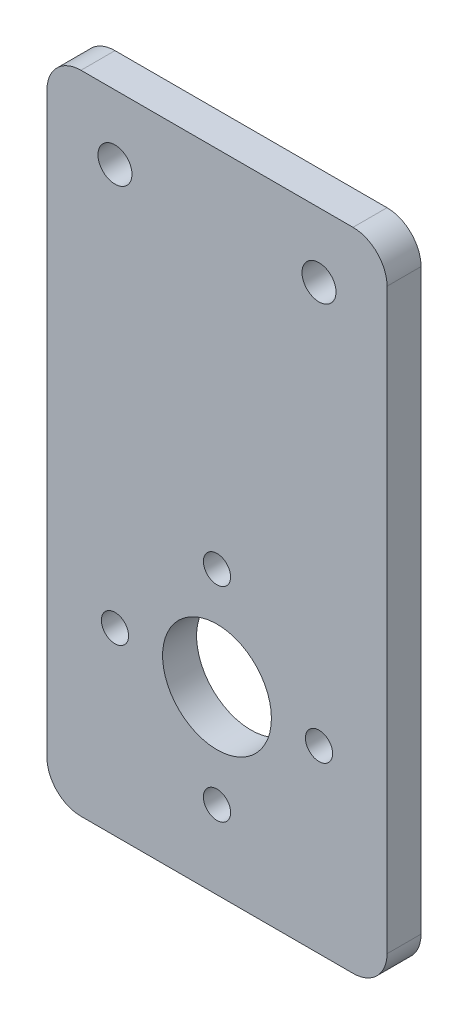
ISO-10303-21;
HEADER;
FILE_DESCRIPTION(('STEP AP214'),'2;1');
FILE_NAME('part.step','',(''),(''),'','','');
FILE_SCHEMA(('AUTOMOTIVE_DESIGN { 1 0 10303 214 1 1 1 1 }'));
ENDSEC;
DATA;
#1=APPLICATION_CONTEXT('core data for automotive mechanical design processes');
#2=APPLICATION_PROTOCOL_DEFINITION('international standard','automotive_design',2000,#1);
#3=PRODUCT_CONTEXT('',#1,'mechanical');
#4=PRODUCT('Part','Part','',(#3));
#5=PRODUCT_RELATED_PRODUCT_CATEGORY('part','',(#4));
#6=PRODUCT_DEFINITION_FORMATION('','',#4);
#7=PRODUCT_DEFINITION_CONTEXT('part definition',#1,'design');
#8=PRODUCT_DEFINITION('design','',#6,#7);
#9=PRODUCT_DEFINITION_SHAPE('','',#8);
#10=(LENGTH_UNIT() NAMED_UNIT(*) SI_UNIT(.MILLI.,.METRE.));
#11=(NAMED_UNIT(*) PLANE_ANGLE_UNIT() SI_UNIT($,.RADIAN.));
#12=(NAMED_UNIT(*) SI_UNIT($,.STERADIAN.) SOLID_ANGLE_UNIT());
#13=UNCERTAINTY_MEASURE_WITH_UNIT(LENGTH_MEASURE(1.E-05),#10,'distance_accuracy_value','');
#14=(GEOMETRIC_REPRESENTATION_CONTEXT(3) GLOBAL_UNCERTAINTY_ASSIGNED_CONTEXT((#13)) GLOBAL_UNIT_ASSIGNED_CONTEXT((#10,
#11,#12)) REPRESENTATION_CONTEXT('',''));
#15=CARTESIAN_POINT('',(0.,0.,0.));
#16=DIRECTION('',(0.,0.,1.));
#17=DIRECTION('',(1.,0.,0.));
#18=AXIS2_PLACEMENT_3D('',#15,#16,#17);
#19=CARTESIAN_POINT('',(0.,0.,5.));
#20=DIRECTION('',(0.,0.,1.));
#21=DIRECTION('',(1.,0.,0.));
#22=AXIS2_PLACEMENT_3D('',#19,#20,#21);
#23=PLANE('',#22);
#24=CARTESIAN_POINT('',(25.0000000000005,-83.525,5.));
#25=DIRECTION('',(0.,0.,1.));
#26=DIRECTION('',(1.,0.,0.));
#27=AXIS2_PLACEMENT_3D('',#24,#25,#26);
#28=CIRCLE('',#27,2.00000000000001);
#29=CARTESIAN_POINT('',(27.0000000000005,-83.525,5.));
#30=VERTEX_POINT('',#29);
#31=EDGE_CURVE('E249',#30,#30,#28,.T.);
#32=ORIENTED_EDGE('',*,*,#31,.F.);
#33=EDGE_LOOP('',(#32));
#34=FACE_BOUND('',#33,.T.);
#35=CARTESIAN_POINT('',(25.,-53.525,5.));
#36=DIRECTION('',(0.,0.,1.));
#37=DIRECTION('',(1.,0.,0.));
#38=AXIS2_PLACEMENT_3D('',#35,#36,#37);
#39=CIRCLE('',#38,2.);
#40=CARTESIAN_POINT('',(27.,-53.525,5.));
#41=VERTEX_POINT('',#40);
#42=EDGE_CURVE('E233',#41,#41,#39,.T.);
#43=ORIENTED_EDGE('',*,*,#42,.F.);
#44=EDGE_LOOP('',(#43));
#45=FACE_BOUND('',#44,.T.);
#46=CARTESIAN_POINT('',(40.,-9.5,5.));
#47=DIRECTION('',(0.,0.,1.));
#48=DIRECTION('',(1.,0.,0.));
#49=AXIS2_PLACEMENT_3D('',#46,#47,#48);
#50=CIRCLE('',#49,2.5);
#51=CARTESIAN_POINT('',(42.5,-9.5,5.));
#52=VERTEX_POINT('',#51);
#53=EDGE_CURVE('E219',#52,#52,#50,.T.);
#54=ORIENTED_EDGE('',*,*,#53,.F.);
#55=EDGE_LOOP('',(#54));
#56=FACE_BOUND('',#55,.T.);
#57=DIRECTION('',(1.,0.,0.));
#58=VECTOR('',#57,1.);
#59=CARTESIAN_POINT('',(0.,-95.,5.));
#60=LINE('',#59,#58);
#61=CARTESIAN_POINT('',(5.00000000000001,-95.,5.));
#62=VERTEX_POINT('',#61);
#63=CARTESIAN_POINT('',(45.,-95.,5.));
#64=VERTEX_POINT('',#63);
#65=EDGE_CURVE('E199',#62,#64,#60,.T.);
#66=ORIENTED_EDGE('',*,*,#65,.T.);
#67=CARTESIAN_POINT('',(45.,-90.,5.));
#68=DIRECTION('',(0.,0.,1.));
#69=DIRECTION('',(1.,0.,0.));
#70=AXIS2_PLACEMENT_3D('',#67,#68,#69);
#71=CIRCLE('',#70,5.);
#72=CARTESIAN_POINT('',(50.,-90.,5.));
#73=VERTEX_POINT('',#72);
#74=EDGE_CURVE('E172',#64,#73,#71,.T.);
#75=ORIENTED_EDGE('',*,*,#74,.T.);
#76=DIRECTION('',(0.,1.,0.));
#77=VECTOR('',#76,1.);
#78=CARTESIAN_POINT('',(50.,0.,5.));
#79=LINE('',#78,#77);
#80=CARTESIAN_POINT('',(50.,-5.,5.));
#81=VERTEX_POINT('',#80);
#82=EDGE_CURVE('E129',#73,#81,#79,.T.);
#83=ORIENTED_EDGE('',*,*,#82,.T.);
#84=CARTESIAN_POINT('',(45.,-5.,5.));
#85=DIRECTION('',(0.,0.,1.));
#86=DIRECTION('',(1.,0.,0.));
#87=AXIS2_PLACEMENT_3D('',#84,#85,#86);
#88=CIRCLE('',#87,5.);
#89=CARTESIAN_POINT('',(45.,0.,5.));
#90=VERTEX_POINT('',#89);
#91=EDGE_CURVE('E64',#81,#90,#88,.T.);
#92=ORIENTED_EDGE('',*,*,#91,.T.);
#93=DIRECTION('',(-1.,0.,0.));
#94=VECTOR('',#93,1.);
#95=CARTESIAN_POINT('',(0.,0.,5.));
#96=LINE('',#95,#94);
#97=CARTESIAN_POINT('',(5.,0.,5.));
#98=VERTEX_POINT('',#97);
#99=EDGE_CURVE('E150',#90,#98,#96,.T.);
#100=ORIENTED_EDGE('',*,*,#99,.T.);
#101=CARTESIAN_POINT('',(5.,-5.,5.));
#102=DIRECTION('',(0.,0.,1.));
#103=DIRECTION('',(1.,0.,0.));
#104=AXIS2_PLACEMENT_3D('',#101,#102,#103);
#105=CIRCLE('',#104,5.);
#106=CARTESIAN_POINT('',(0.,-5.,5.));
#107=VERTEX_POINT('',#106);
#108=EDGE_CURVE('E166',#98,#107,#105,.T.);
#109=ORIENTED_EDGE('',*,*,#108,.T.);
#110=DIRECTION('',(0.,-1.,0.));
#111=VECTOR('',#110,1.);
#112=CARTESIAN_POINT('',(0.,0.,5.));
#113=LINE('',#112,#111);
#114=CARTESIAN_POINT('',(0.,-90.,5.));
#115=VERTEX_POINT('',#114);
#116=EDGE_CURVE('E143',#107,#115,#113,.T.);
#117=ORIENTED_EDGE('',*,*,#116,.T.);
#118=CARTESIAN_POINT('',(5.00000000000001,-90.,5.));
#119=DIRECTION('',(0.,0.,1.));
#120=DIRECTION('',(1.,0.,0.));
#121=AXIS2_PLACEMENT_3D('',#118,#119,#120);
#122=CIRCLE('',#121,5.);
#123=EDGE_CURVE('E169',#115,#62,#122,.T.);
#124=ORIENTED_EDGE('',*,*,#123,.T.);
#125=EDGE_LOOP('',(#66,#75,#83,#92,#100,#109,#117,#124));
#126=FACE_BOUND('',#125,.T.);
#127=CARTESIAN_POINT('',(10.,-9.5,5.));
#128=DIRECTION('',(0.,0.,1.));
#129=DIRECTION('',(1.,0.,0.));
#130=AXIS2_PLACEMENT_3D('',#127,#128,#129);
#131=CIRCLE('',#130,2.5);
#132=CARTESIAN_POINT('',(12.5,-9.5,5.));
#133=VERTEX_POINT('',#132);
#134=EDGE_CURVE('E212',#133,#133,#131,.T.);
#135=ORIENTED_EDGE('',*,*,#134,.F.);
#136=EDGE_LOOP('',(#135));
#137=FACE_BOUND('',#136,.T.);
#138=CARTESIAN_POINT('',(25.,-68.525,5.));
#139=DIRECTION('',(0.,0.,1.));
#140=DIRECTION('',(1.,0.,0.));
#141=AXIS2_PLACEMENT_3D('',#138,#139,#140);
#142=CIRCLE('',#141,8.);
#143=CARTESIAN_POINT('',(33.,-68.525,5.));
#144=VERTEX_POINT('',#143);
#145=EDGE_CURVE('E225',#144,#144,#142,.T.);
#146=ORIENTED_EDGE('',*,*,#145,.F.);
#147=EDGE_LOOP('',(#146));
#148=FACE_BOUND('',#147,.T.);
#149=CARTESIAN_POINT('',(40.0000000000003,-68.5249999999997,5.));
#150=DIRECTION('',(0.,0.,1.));
#151=DIRECTION('',(1.,0.,0.));
#152=AXIS2_PLACEMENT_3D('',#149,#150,#151);
#153=CIRCLE('',#152,2.);
#154=CARTESIAN_POINT('',(42.0000000000003,-68.5249999999997,5.));
#155=VERTEX_POINT('',#154);
#156=EDGE_CURVE('E241',#155,#155,#153,.T.);
#157=ORIENTED_EDGE('',*,*,#156,.F.);
#158=EDGE_LOOP('',(#157));
#159=FACE_BOUND('',#158,.T.);
#160=CARTESIAN_POINT('',(10.0000000000003,-68.5250000000002,5.));
#161=DIRECTION('',(0.,0.,1.));
#162=DIRECTION('',(1.,0.,0.));
#163=AXIS2_PLACEMENT_3D('',#160,#161,#162);
#164=CIRCLE('',#163,2.);
#165=CARTESIAN_POINT('',(12.0000000000003,-68.5250000000002,5.));
#166=VERTEX_POINT('',#165);
#167=EDGE_CURVE('E257',#166,#166,#164,.T.);
#168=ORIENTED_EDGE('',*,*,#167,.F.);
#169=EDGE_LOOP('',(#168));
#170=FACE_BOUND('',#169,.T.);
#171=ADVANCED_FACE('F43',(#34,#45,#56,#126,#137,#148,#159,#170),#23,.T.);
#172=CARTESIAN_POINT('',(0.,0.,0.));
#173=DIRECTION('',(0.,0.,1.));
#174=DIRECTION('',(1.,0.,0.));
#175=AXIS2_PLACEMENT_3D('',#172,#173,#174);
#176=PLANE('',#175);
#177=DIRECTION('',(0.,1.,0.));
#178=VECTOR('',#177,1.);
#179=CARTESIAN_POINT('',(50.,0.,0.));
#180=LINE('',#179,#178);
#181=CARTESIAN_POINT('',(50.,-90.,0.));
#182=VERTEX_POINT('',#181);
#183=CARTESIAN_POINT('',(50.,-5.,0.));
#184=VERTEX_POINT('',#183);
#185=EDGE_CURVE('E127',#182,#184,#180,.T.);
#186=ORIENTED_EDGE('',*,*,#185,.F.);
#187=CARTESIAN_POINT('',(45.,-90.,0.));
#188=DIRECTION('',(0.,0.,1.));
#189=DIRECTION('',(1.,0.,0.));
#190=AXIS2_PLACEMENT_3D('',#187,#188,#189);
#191=CIRCLE('',#190,5.);
#192=CARTESIAN_POINT('',(45.,-95.,0.));
#193=VERTEX_POINT('',#192);
#194=EDGE_CURVE('E109',#182,#193,#191,.F.);
#195=ORIENTED_EDGE('',*,*,#194,.T.);
#196=DIRECTION('',(1.,0.,0.));
#197=VECTOR('',#196,1.);
#198=CARTESIAN_POINT('',(0.,-95.,0.));
#199=LINE('',#198,#197);
#200=CARTESIAN_POINT('',(5.00000000000001,-95.,0.));
#201=VERTEX_POINT('',#200);
#202=EDGE_CURVE('E139',#201,#193,#199,.T.);
#203=ORIENTED_EDGE('',*,*,#202,.F.);
#204=CARTESIAN_POINT('',(5.00000000000001,-90.,0.));
#205=DIRECTION('',(0.,0.,1.));
#206=DIRECTION('',(1.,0.,0.));
#207=AXIS2_PLACEMENT_3D('',#204,#205,#206);
#208=CIRCLE('',#207,5.);
#209=CARTESIAN_POINT('',(0.,-90.,0.));
#210=VERTEX_POINT('',#209);
#211=EDGE_CURVE('E121',#201,#210,#208,.F.);
#212=ORIENTED_EDGE('',*,*,#211,.T.);
#213=DIRECTION('',(0.,-1.,0.));
#214=VECTOR('',#213,1.);
#215=CARTESIAN_POINT('',(0.,0.,0.));
#216=LINE('',#215,#214);
#217=CARTESIAN_POINT('',(0.,-5.,0.));
#218=VERTEX_POINT('',#217);
#219=EDGE_CURVE('E145',#218,#210,#216,.T.);
#220=ORIENTED_EDGE('',*,*,#219,.F.);
#221=CARTESIAN_POINT('',(5.,-5.,0.));
#222=DIRECTION('',(0.,0.,1.));
#223=DIRECTION('',(1.,0.,0.));
#224=AXIS2_PLACEMENT_3D('',#221,#222,#223);
#225=CIRCLE('',#224,5.);
#226=CARTESIAN_POINT('',(5.,0.,0.));
#227=VERTEX_POINT('',#226);
#228=EDGE_CURVE('E154',#218,#227,#225,.F.);
#229=ORIENTED_EDGE('',*,*,#228,.T.);
#230=DIRECTION('',(-1.,0.,0.));
#231=VECTOR('',#230,1.);
#232=CARTESIAN_POINT('',(0.,0.,0.));
#233=LINE('',#232,#231);
#234=CARTESIAN_POINT('',(45.,0.,0.));
#235=VERTEX_POINT('',#234);
#236=EDGE_CURVE('E138',#235,#227,#233,.T.);
#237=ORIENTED_EDGE('',*,*,#236,.F.);
#238=CARTESIAN_POINT('',(45.,-5.,0.));
#239=DIRECTION('',(0.,0.,1.));
#240=DIRECTION('',(1.,0.,0.));
#241=AXIS2_PLACEMENT_3D('',#238,#239,#240);
#242=CIRCLE('',#241,5.);
#243=EDGE_CURVE('E131',#235,#184,#242,.F.);
#244=ORIENTED_EDGE('',*,*,#243,.T.);
#245=EDGE_LOOP('',(#186,#195,#203,#212,#220,#229,#237,#244));
#246=FACE_BOUND('',#245,.T.);
#247=CARTESIAN_POINT('',(10.,-9.5,0.));
#248=DIRECTION('',(0.,0.,1.));
#249=DIRECTION('',(1.,0.,0.));
#250=AXIS2_PLACEMENT_3D('',#247,#248,#249);
#251=CIRCLE('',#250,2.5);
#252=CARTESIAN_POINT('',(12.5,-9.5,0.));
#253=VERTEX_POINT('',#252);
#254=EDGE_CURVE('E205',#253,#253,#251,.T.);
#255=ORIENTED_EDGE('',*,*,#254,.T.);
#256=EDGE_LOOP('',(#255));
#257=FACE_BOUND('',#256,.T.);
#258=CARTESIAN_POINT('',(40.,-9.5,0.));
#259=DIRECTION('',(0.,0.,1.));
#260=DIRECTION('',(1.,0.,0.));
#261=AXIS2_PLACEMENT_3D('',#258,#259,#260);
#262=CIRCLE('',#261,2.5);
#263=CARTESIAN_POINT('',(42.5,-9.5,0.));
#264=VERTEX_POINT('',#263);
#265=EDGE_CURVE('E221',#264,#264,#262,.T.);
#266=ORIENTED_EDGE('',*,*,#265,.T.);
#267=EDGE_LOOP('',(#266));
#268=FACE_BOUND('',#267,.T.);
#269=CARTESIAN_POINT('',(25.,-68.525,0.));
#270=DIRECTION('',(0.,0.,1.));
#271=DIRECTION('',(1.,0.,0.));
#272=AXIS2_PLACEMENT_3D('',#269,#270,#271);
#273=CIRCLE('',#272,8.);
#274=CARTESIAN_POINT('',(33.,-68.525,0.));
#275=VERTEX_POINT('',#274);
#276=EDGE_CURVE('E229',#275,#275,#273,.T.);
#277=ORIENTED_EDGE('',*,*,#276,.T.);
#278=EDGE_LOOP('',(#277));
#279=FACE_BOUND('',#278,.T.);
#280=CARTESIAN_POINT('',(25.,-53.525,0.));
#281=DIRECTION('',(0.,0.,1.));
#282=DIRECTION('',(1.,0.,0.));
#283=AXIS2_PLACEMENT_3D('',#280,#281,#282);
#284=CIRCLE('',#283,2.);
#285=CARTESIAN_POINT('',(27.,-53.525,0.));
#286=VERTEX_POINT('',#285);
#287=EDGE_CURVE('E237',#286,#286,#284,.T.);
#288=ORIENTED_EDGE('',*,*,#287,.T.);
#289=EDGE_LOOP('',(#288));
#290=FACE_BOUND('',#289,.T.);
#291=CARTESIAN_POINT('',(40.0000000000003,-68.5249999999997,0.));
#292=DIRECTION('',(0.,0.,1.));
#293=DIRECTION('',(1.,0.,0.));
#294=AXIS2_PLACEMENT_3D('',#291,#292,#293);
#295=CIRCLE('',#294,2.);
#296=CARTESIAN_POINT('',(42.0000000000003,-68.5249999999997,0.));
#297=VERTEX_POINT('',#296);
#298=EDGE_CURVE('E245',#297,#297,#295,.T.);
#299=ORIENTED_EDGE('',*,*,#298,.T.);
#300=EDGE_LOOP('',(#299));
#301=FACE_BOUND('',#300,.T.);
#302=CARTESIAN_POINT('',(25.0000000000005,-83.525,0.));
#303=DIRECTION('',(0.,0.,1.));
#304=DIRECTION('',(1.,0.,0.));
#305=AXIS2_PLACEMENT_3D('',#302,#303,#304);
#306=CIRCLE('',#305,2.00000000000001);
#307=CARTESIAN_POINT('',(27.0000000000005,-83.525,0.));
#308=VERTEX_POINT('',#307);
#309=EDGE_CURVE('E253',#308,#308,#306,.T.);
#310=ORIENTED_EDGE('',*,*,#309,.T.);
#311=EDGE_LOOP('',(#310));
#312=FACE_BOUND('',#311,.T.);
#313=CARTESIAN_POINT('',(10.0000000000003,-68.5250000000002,0.));
#314=DIRECTION('',(0.,0.,1.));
#315=DIRECTION('',(1.,0.,0.));
#316=AXIS2_PLACEMENT_3D('',#313,#314,#315);
#317=CIRCLE('',#316,2.);
#318=CARTESIAN_POINT('',(12.0000000000003,-68.5250000000002,0.));
#319=VERTEX_POINT('',#318);
#320=EDGE_CURVE('E261',#319,#319,#317,.T.);
#321=ORIENTED_EDGE('',*,*,#320,.T.);
#322=EDGE_LOOP('',(#321));
#323=FACE_BOUND('',#322,.T.);
#324=ADVANCED_FACE('F134',(#246,#257,#268,#279,#290,#301,#312,#323),#176,.F.);
#325=CARTESIAN_POINT('',(0.,0.,5.));
#326=DIRECTION('',(1.,0.,0.));
#327=DIRECTION('',(0.,1.,0.));
#328=AXIS2_PLACEMENT_3D('',#325,#326,#327);
#329=PLANE('',#328);
#330=ORIENTED_EDGE('',*,*,#219,.T.);
#331=DIRECTION('',(0.,0.,-1.));
#332=VECTOR('',#331,1.);
#333=CARTESIAN_POINT('',(0.,-90.,5.));
#334=LINE('',#333,#332);
#335=EDGE_CURVE('E179',#210,#115,#334,.F.);
#336=ORIENTED_EDGE('',*,*,#335,.T.);
#337=ORIENTED_EDGE('',*,*,#116,.F.);
#338=DIRECTION('',(0.,0.,-1.));
#339=VECTOR('',#338,1.);
#340=CARTESIAN_POINT('',(0.,-5.,5.));
#341=LINE('',#340,#339);
#342=EDGE_CURVE('E175',#107,#218,#341,.T.);
#343=ORIENTED_EDGE('',*,*,#342,.T.);
#344=EDGE_LOOP('',(#330,#336,#337,#343));
#345=FACE_BOUND('',#344,.T.);
#346=ADVANCED_FACE('F194',(#345),#329,.F.);
#347=CARTESIAN_POINT('',(0.,-95.,5.));
#348=DIRECTION('',(0.,1.,0.));
#349=DIRECTION('',(0.,0.,1.));
#350=AXIS2_PLACEMENT_3D('',#347,#348,#349);
#351=PLANE('',#350);
#352=ORIENTED_EDGE('',*,*,#202,.T.);
#353=DIRECTION('',(0.,0.,-1.));
#354=VECTOR('',#353,1.);
#355=CARTESIAN_POINT('',(45.,-95.,5.));
#356=LINE('',#355,#354);
#357=EDGE_CURVE('E114',#193,#64,#356,.F.);
#358=ORIENTED_EDGE('',*,*,#357,.T.);
#359=ORIENTED_EDGE('',*,*,#65,.F.);
#360=DIRECTION('',(0.,0.,-1.));
#361=VECTOR('',#360,1.);
#362=CARTESIAN_POINT('',(5.00000000000001,-95.,5.));
#363=LINE('',#362,#361);
#364=EDGE_CURVE('E120',#62,#201,#363,.T.);
#365=ORIENTED_EDGE('',*,*,#364,.T.);
#366=EDGE_LOOP('',(#352,#358,#359,#365));
#367=FACE_BOUND('',#366,.T.);
#368=ADVANCED_FACE('F289',(#367),#351,.F.);
#369=CARTESIAN_POINT('',(50.,0.,5.));
#370=DIRECTION('',(-1.,0.,0.));
#371=DIRECTION('',(0.,-1.,0.));
#372=AXIS2_PLACEMENT_3D('',#369,#370,#371);
#373=PLANE('',#372);
#374=ORIENTED_EDGE('',*,*,#82,.F.);
#375=DIRECTION('',(0.,0.,-1.));
#376=VECTOR('',#375,1.);
#377=CARTESIAN_POINT('',(50.,-90.,5.));
#378=LINE('',#377,#376);
#379=EDGE_CURVE('E113',#73,#182,#378,.T.);
#380=ORIENTED_EDGE('',*,*,#379,.T.);
#381=ORIENTED_EDGE('',*,*,#185,.T.);
#382=DIRECTION('',(0.,0.,-1.));
#383=VECTOR('',#382,1.);
#384=CARTESIAN_POINT('',(50.,-5.,5.));
#385=LINE('',#384,#383);
#386=EDGE_CURVE('E132',#184,#81,#385,.F.);
#387=ORIENTED_EDGE('',*,*,#386,.T.);
#388=EDGE_LOOP('',(#374,#380,#381,#387));
#389=FACE_BOUND('',#388,.T.);
#390=ADVANCED_FACE('F126',(#389),#373,.F.);
#391=CARTESIAN_POINT('',(0.,0.,5.));
#392=DIRECTION('',(0.,-1.,0.));
#393=DIRECTION('',(0.,0.,-1.));
#394=AXIS2_PLACEMENT_3D('',#391,#392,#393);
#395=PLANE('',#394);
#396=ORIENTED_EDGE('',*,*,#236,.T.);
#397=DIRECTION('',(0.,0.,-1.));
#398=VECTOR('',#397,1.);
#399=CARTESIAN_POINT('',(5.,0.,5.));
#400=LINE('',#399,#398);
#401=EDGE_CURVE('E11',#227,#98,#400,.F.);
#402=ORIENTED_EDGE('',*,*,#401,.T.);
#403=ORIENTED_EDGE('',*,*,#99,.F.);
#404=DIRECTION('',(0.,0.,-1.));
#405=VECTOR('',#404,1.);
#406=CARTESIAN_POINT('',(45.,0.,5.));
#407=LINE('',#406,#405);
#408=EDGE_CURVE('E52',#90,#235,#407,.T.);
#409=ORIENTED_EDGE('',*,*,#408,.T.);
#410=EDGE_LOOP('',(#396,#402,#403,#409));
#411=FACE_BOUND('',#410,.T.);
#412=ADVANCED_FACE('F184',(#411),#395,.F.);
#413=CARTESIAN_POINT('',(10.,-9.5,5.));
#414=DIRECTION('',(0.,0.,-1.));
#415=DIRECTION('',(-1.,0.,0.));
#416=AXIS2_PLACEMENT_3D('',#413,#414,#415);
#417=CYLINDRICAL_SURFACE('',#416,2.5);
#418=ORIENTED_EDGE('',*,*,#134,.T.);
#419=EDGE_LOOP('',(#418));
#420=FACE_BOUND('',#419,.T.);
#421=ORIENTED_EDGE('',*,*,#254,.F.);
#422=EDGE_LOOP('',(#421));
#423=FACE_BOUND('',#422,.T.);
#424=ADVANCED_FACE('F282',(#420,#423),#417,.F.);
#425=CARTESIAN_POINT('',(40.,-9.5,5.));
#426=DIRECTION('',(0.,0.,-1.));
#427=DIRECTION('',(-1.,0.,0.));
#428=AXIS2_PLACEMENT_3D('',#425,#426,#427);
#429=CYLINDRICAL_SURFACE('',#428,2.5);
#430=ORIENTED_EDGE('',*,*,#53,.T.);
#431=EDGE_LOOP('',(#430));
#432=FACE_BOUND('',#431,.T.);
#433=ORIENTED_EDGE('',*,*,#265,.F.);
#434=EDGE_LOOP('',(#433));
#435=FACE_BOUND('',#434,.T.);
#436=ADVANCED_FACE('F339',(#432,#435),#429,.F.);
#437=CARTESIAN_POINT('',(25.,-68.525,5.));
#438=DIRECTION('',(0.,0.,-1.));
#439=DIRECTION('',(-1.,0.,0.));
#440=AXIS2_PLACEMENT_3D('',#437,#438,#439);
#441=CYLINDRICAL_SURFACE('',#440,8.);
#442=ORIENTED_EDGE('',*,*,#145,.T.);
#443=EDGE_LOOP('',(#442));
#444=FACE_BOUND('',#443,.T.);
#445=ORIENTED_EDGE('',*,*,#276,.F.);
#446=EDGE_LOOP('',(#445));
#447=FACE_BOUND('',#446,.T.);
#448=ADVANCED_FACE('F336',(#444,#447),#441,.F.);
#449=CARTESIAN_POINT('',(25.,-53.525,5.));
#450=DIRECTION('',(0.,0.,-1.));
#451=DIRECTION('',(-1.,0.,0.));
#452=AXIS2_PLACEMENT_3D('',#449,#450,#451);
#453=CYLINDRICAL_SURFACE('',#452,2.);
#454=ORIENTED_EDGE('',*,*,#42,.T.);
#455=EDGE_LOOP('',(#454));
#456=FACE_BOUND('',#455,.T.);
#457=ORIENTED_EDGE('',*,*,#287,.F.);
#458=EDGE_LOOP('',(#457));
#459=FACE_BOUND('',#458,.T.);
#460=ADVANCED_FACE('F318',(#456,#459),#453,.F.);
#461=CARTESIAN_POINT('',(40.0000000000003,-68.5249999999997,5.));
#462=DIRECTION('',(0.,0.,-1.));
#463=DIRECTION('',(-1.,0.,0.));
#464=AXIS2_PLACEMENT_3D('',#461,#462,#463);
#465=CYLINDRICAL_SURFACE('',#464,2.);
#466=ORIENTED_EDGE('',*,*,#156,.T.);
#467=EDGE_LOOP('',(#466));
#468=FACE_BOUND('',#467,.T.);
#469=ORIENTED_EDGE('',*,*,#298,.F.);
#470=EDGE_LOOP('',(#469));
#471=FACE_BOUND('',#470,.T.);
#472=ADVANCED_FACE('F314',(#468,#471),#465,.F.);
#473=CARTESIAN_POINT('',(25.0000000000005,-83.525,5.));
#474=DIRECTION('',(0.,0.,-1.));
#475=DIRECTION('',(-1.,0.,0.));
#476=AXIS2_PLACEMENT_3D('',#473,#474,#475);
#477=CYLINDRICAL_SURFACE('',#476,2.00000000000001);
#478=ORIENTED_EDGE('',*,*,#31,.T.);
#479=EDGE_LOOP('',(#478));
#480=FACE_BOUND('',#479,.T.);
#481=ORIENTED_EDGE('',*,*,#309,.F.);
#482=EDGE_LOOP('',(#481));
#483=FACE_BOUND('',#482,.T.);
#484=ADVANCED_FACE('F317',(#480,#483),#477,.F.);
#485=CARTESIAN_POINT('',(10.0000000000003,-68.5250000000002,5.));
#486=DIRECTION('',(0.,0.,-1.));
#487=DIRECTION('',(-1.,0.,0.));
#488=AXIS2_PLACEMENT_3D('',#485,#486,#487);
#489=CYLINDRICAL_SURFACE('',#488,2.);
#490=ORIENTED_EDGE('',*,*,#167,.T.);
#491=EDGE_LOOP('',(#490));
#492=FACE_BOUND('',#491,.T.);
#493=ORIENTED_EDGE('',*,*,#320,.F.);
#494=EDGE_LOOP('',(#493));
#495=FACE_BOUND('',#494,.T.);
#496=ADVANCED_FACE('F269',(#492,#495),#489,.F.);
#497=CARTESIAN_POINT('',(45.,-90.,5.));
#498=DIRECTION('',(0.,0.,-1.));
#499=DIRECTION('',(-1.,0.,0.));
#500=AXIS2_PLACEMENT_3D('',#497,#498,#499);
#501=CYLINDRICAL_SURFACE('',#500,5.);
#502=ORIENTED_EDGE('',*,*,#74,.F.);
#503=ORIENTED_EDGE('',*,*,#357,.F.);
#504=ORIENTED_EDGE('',*,*,#194,.F.);
#505=ORIENTED_EDGE('',*,*,#379,.F.);
#506=EDGE_LOOP('',(#502,#503,#504,#505));
#507=FACE_BOUND('',#506,.T.);
#508=ADVANCED_FACE('F112',(#507),#501,.T.);
#509=CARTESIAN_POINT('',(5.00000000000001,-90.,5.));
#510=DIRECTION('',(0.,0.,-1.));
#511=DIRECTION('',(-1.,0.,0.));
#512=AXIS2_PLACEMENT_3D('',#509,#510,#511);
#513=CYLINDRICAL_SURFACE('',#512,5.);
#514=ORIENTED_EDGE('',*,*,#123,.F.);
#515=ORIENTED_EDGE('',*,*,#335,.F.);
#516=ORIENTED_EDGE('',*,*,#211,.F.);
#517=ORIENTED_EDGE('',*,*,#364,.F.);
#518=EDGE_LOOP('',(#514,#515,#516,#517));
#519=FACE_BOUND('',#518,.T.);
#520=ADVANCED_FACE('F297',(#519),#513,.T.);
#521=CARTESIAN_POINT('',(5.,-5.,5.));
#522=DIRECTION('',(0.,0.,-1.));
#523=DIRECTION('',(-1.,0.,0.));
#524=AXIS2_PLACEMENT_3D('',#521,#522,#523);
#525=CYLINDRICAL_SURFACE('',#524,5.);
#526=ORIENTED_EDGE('',*,*,#108,.F.);
#527=ORIENTED_EDGE('',*,*,#401,.F.);
#528=ORIENTED_EDGE('',*,*,#228,.F.);
#529=ORIENTED_EDGE('',*,*,#342,.F.);
#530=EDGE_LOOP('',(#526,#527,#528,#529));
#531=FACE_BOUND('',#530,.T.);
#532=ADVANCED_FACE('F191',(#531),#525,.T.);
#533=CARTESIAN_POINT('',(45.,-5.,5.));
#534=DIRECTION('',(0.,0.,-1.));
#535=DIRECTION('',(-1.,0.,0.));
#536=AXIS2_PLACEMENT_3D('',#533,#534,#535);
#537=CYLINDRICAL_SURFACE('',#536,5.);
#538=ORIENTED_EDGE('',*,*,#91,.F.);
#539=ORIENTED_EDGE('',*,*,#386,.F.);
#540=ORIENTED_EDGE('',*,*,#243,.F.);
#541=ORIENTED_EDGE('',*,*,#408,.F.);
#542=EDGE_LOOP('',(#538,#539,#540,#541));
#543=FACE_BOUND('',#542,.T.);
#544=ADVANCED_FACE('F45',(#543),#537,.T.);
#545=CLOSED_SHELL('',(#171,#324,#346,#368,#390,#412,#424,#436,#448,#460,#472,#484,#496,#508,
#520,#532,#544));
#546=MANIFOLD_SOLID_BREP('B2',#545);
#547=ADVANCED_BREP_SHAPE_REPRESENTATION('',(#18,#546),#14);
#548=SHAPE_DEFINITION_REPRESENTATION(#9,#547);
ENDSEC;
END-ISO-10303-21;
